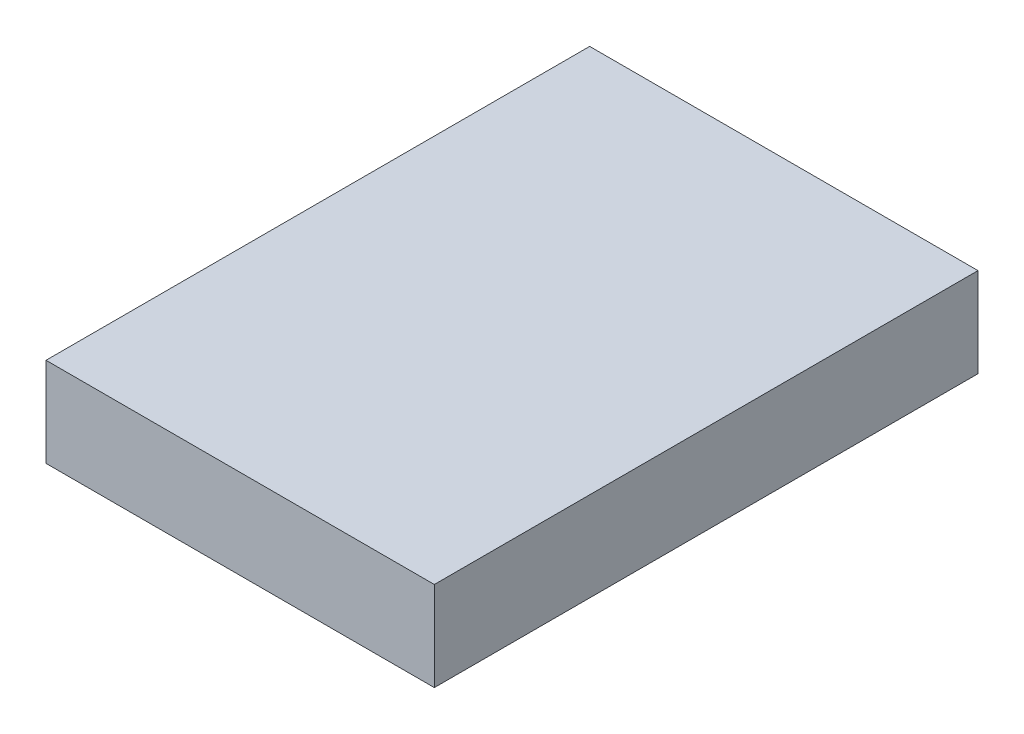
ISO-10303-21;
HEADER;
FILE_DESCRIPTION(('STEP AP214'),'2;1');
FILE_NAME('part.step','',(''),(''),'','','');
FILE_SCHEMA(('AUTOMOTIVE_DESIGN { 1 0 10303 214 1 1 1 1 }'));
ENDSEC;
DATA;
#1=APPLICATION_CONTEXT('core data for automotive mechanical design processes');
#2=APPLICATION_PROTOCOL_DEFINITION('international standard','automotive_design',2000,#1);
#3=PRODUCT_CONTEXT('',#1,'mechanical');
#4=PRODUCT('Part','Part','',(#3));
#5=PRODUCT_RELATED_PRODUCT_CATEGORY('part','',(#4));
#6=PRODUCT_DEFINITION_FORMATION('','',#4);
#7=PRODUCT_DEFINITION_CONTEXT('part definition',#1,'design');
#8=PRODUCT_DEFINITION('design','',#6,#7);
#9=PRODUCT_DEFINITION_SHAPE('','',#8);
#10=(LENGTH_UNIT() NAMED_UNIT(*) SI_UNIT(.MILLI.,.METRE.));
#11=(NAMED_UNIT(*) PLANE_ANGLE_UNIT() SI_UNIT($,.RADIAN.));
#12=(NAMED_UNIT(*) SI_UNIT($,.STERADIAN.) SOLID_ANGLE_UNIT());
#13=UNCERTAINTY_MEASURE_WITH_UNIT(LENGTH_MEASURE(1.E-05),#10,'distance_accuracy_value','');
#14=(GEOMETRIC_REPRESENTATION_CONTEXT(3) GLOBAL_UNCERTAINTY_ASSIGNED_CONTEXT((#13)) GLOBAL_UNIT_ASSIGNED_CONTEXT((#10,
#11,#12)) REPRESENTATION_CONTEXT('',''));
#15=CARTESIAN_POINT('',(0.,0.,0.));
#16=DIRECTION('',(0.,0.,1.));
#17=DIRECTION('',(1.,0.,0.));
#18=AXIS2_PLACEMENT_3D('',#15,#16,#17);
#19=CARTESIAN_POINT('',(-2.08762886597938,5.75,-18.8530927835052));
#20=DIRECTION('',(1.,0.,0.));
#21=DIRECTION('',(0.,0.,-1.));
#22=AXIS2_PLACEMENT_3D('',#19,#20,#21);
#23=PLANE('',#22);
#24=DIRECTION('',(0.,0.,1.));
#25=VECTOR('',#24,1.);
#26=CARTESIAN_POINT('',(-2.08762886597938,0.,-18.8530927835052));
#27=LINE('',#26,#25);
#28=CARTESIAN_POINT('',(-2.08762886597938,0.,-18.8530927835052));
#29=VERTEX_POINT('',#28);
#30=CARTESIAN_POINT('',(-2.08762886597938,0.,16.1469072164948));
#31=VERTEX_POINT('',#30);
#32=EDGE_CURVE('E95',#29,#31,#27,.T.);
#33=ORIENTED_EDGE('',*,*,#32,.T.);
#34=DIRECTION('',(0.,-1.,0.));
#35=VECTOR('',#34,1.);
#36=CARTESIAN_POINT('',(-2.08762886597938,5.75,16.1469072164948));
#37=LINE('',#36,#35);
#38=CARTESIAN_POINT('',(-2.08762886597938,5.75,16.1469072164948));
#39=VERTEX_POINT('',#38);
#40=EDGE_CURVE('E11',#39,#31,#37,.T.);
#41=ORIENTED_EDGE('',*,*,#40,.F.);
#42=DIRECTION('',(0.,0.,1.));
#43=VECTOR('',#42,1.);
#44=CARTESIAN_POINT('',(-2.08762886597938,5.75,-18.8530927835052));
#45=LINE('',#44,#43);
#46=CARTESIAN_POINT('',(-2.08762886597938,5.75,-18.8530927835052));
#47=VERTEX_POINT('',#46);
#48=EDGE_CURVE('E83',#47,#39,#45,.T.);
#49=ORIENTED_EDGE('',*,*,#48,.F.);
#50=DIRECTION('',(0.,-1.,0.));
#51=VECTOR('',#50,1.);
#52=CARTESIAN_POINT('',(-2.08762886597938,5.75,-18.8530927835052));
#53=LINE('',#52,#51);
#54=EDGE_CURVE('E91',#47,#29,#53,.T.);
#55=ORIENTED_EDGE('',*,*,#54,.T.);
#56=EDGE_LOOP('',(#33,#41,#49,#55));
#57=FACE_BOUND('',#56,.T.);
#58=ADVANCED_FACE('F32',(#57),#23,.F.);
#59=CARTESIAN_POINT('',(-2.08762886597938,5.75,16.1469072164948));
#60=DIRECTION('',(0.,0.,-1.));
#61=DIRECTION('',(-1.,0.,0.));
#62=AXIS2_PLACEMENT_3D('',#59,#60,#61);
#63=PLANE('',#62);
#64=DIRECTION('',(1.,0.,0.));
#65=VECTOR('',#64,1.);
#66=CARTESIAN_POINT('',(-2.08762886597938,0.,16.1469072164948));
#67=LINE('',#66,#65);
#68=CARTESIAN_POINT('',(22.9123711340206,0.,16.1469072164948));
#69=VERTEX_POINT('',#68);
#70=EDGE_CURVE('E87',#31,#69,#67,.T.);
#71=ORIENTED_EDGE('',*,*,#70,.T.);
#72=DIRECTION('',(0.,-1.,0.));
#73=VECTOR('',#72,1.);
#74=CARTESIAN_POINT('',(22.9123711340206,5.75,16.1469072164948));
#75=LINE('',#74,#73);
#76=CARTESIAN_POINT('',(22.9123711340206,5.75,16.1469072164948));
#77=VERTEX_POINT('',#76);
#78=EDGE_CURVE('E40',#77,#69,#75,.T.);
#79=ORIENTED_EDGE('',*,*,#78,.F.);
#80=DIRECTION('',(1.,0.,0.));
#81=VECTOR('',#80,1.);
#82=CARTESIAN_POINT('',(-2.08762886597938,5.75,16.1469072164948));
#83=LINE('',#82,#81);
#84=EDGE_CURVE('E78',#39,#77,#83,.T.);
#85=ORIENTED_EDGE('',*,*,#84,.F.);
#86=ORIENTED_EDGE('',*,*,#40,.T.);
#87=EDGE_LOOP('',(#71,#79,#85,#86));
#88=FACE_BOUND('',#87,.T.);
#89=ADVANCED_FACE('F86',(#88),#63,.F.);
#90=CARTESIAN_POINT('',(22.9123711340206,5.75,-18.8530927835052));
#91=DIRECTION('',(-1.,0.,0.));
#92=DIRECTION('',(0.,0.,1.));
#93=AXIS2_PLACEMENT_3D('',#90,#91,#92);
#94=PLANE('',#93);
#95=DIRECTION('',(0.,0.,-1.));
#96=VECTOR('',#95,1.);
#97=CARTESIAN_POINT('',(22.9123711340206,0.,-18.8530927835052));
#98=LINE('',#97,#96);
#99=CARTESIAN_POINT('',(22.9123711340206,0.,-18.8530927835052));
#100=VERTEX_POINT('',#99);
#101=EDGE_CURVE('E65',#69,#100,#98,.T.);
#102=ORIENTED_EDGE('',*,*,#101,.T.);
#103=DIRECTION('',(0.,-1.,0.));
#104=VECTOR('',#103,1.);
#105=CARTESIAN_POINT('',(22.9123711340206,5.75,-18.8530927835052));
#106=LINE('',#105,#104);
#107=CARTESIAN_POINT('',(22.9123711340206,5.75,-18.8530927835052));
#108=VERTEX_POINT('',#107);
#109=EDGE_CURVE('E88',#108,#100,#106,.T.);
#110=ORIENTED_EDGE('',*,*,#109,.F.);
#111=DIRECTION('',(0.,0.,-1.));
#112=VECTOR('',#111,1.);
#113=CARTESIAN_POINT('',(22.9123711340206,5.75,-18.8530927835052));
#114=LINE('',#113,#112);
#115=EDGE_CURVE('E81',#77,#108,#114,.T.);
#116=ORIENTED_EDGE('',*,*,#115,.F.);
#117=ORIENTED_EDGE('',*,*,#78,.T.);
#118=EDGE_LOOP('',(#102,#110,#116,#117));
#119=FACE_BOUND('',#118,.T.);
#120=ADVANCED_FACE('F89',(#119),#94,.F.);
#121=CARTESIAN_POINT('',(-2.08762886597938,5.75,-18.8530927835052));
#122=DIRECTION('',(0.,0.,1.));
#123=DIRECTION('',(1.,0.,0.));
#124=AXIS2_PLACEMENT_3D('',#121,#122,#123);
#125=PLANE('',#124);
#126=DIRECTION('',(-1.,0.,0.));
#127=VECTOR('',#126,1.);
#128=CARTESIAN_POINT('',(-2.08762886597938,0.,-18.8530927835052));
#129=LINE('',#128,#127);
#130=EDGE_CURVE('E71',#100,#29,#129,.T.);
#131=ORIENTED_EDGE('',*,*,#130,.T.);
#132=ORIENTED_EDGE('',*,*,#54,.F.);
#133=DIRECTION('',(-1.,0.,0.));
#134=VECTOR('',#133,1.);
#135=CARTESIAN_POINT('',(-2.08762886597938,5.75,-18.8530927835052));
#136=LINE('',#135,#134);
#137=EDGE_CURVE('E48',#108,#47,#136,.T.);
#138=ORIENTED_EDGE('',*,*,#137,.F.);
#139=ORIENTED_EDGE('',*,*,#109,.T.);
#140=EDGE_LOOP('',(#131,#132,#138,#139));
#141=FACE_BOUND('',#140,.T.);
#142=ADVANCED_FACE('F102',(#141),#125,.F.);
#143=CARTESIAN_POINT('',(0.,5.75,0.));
#144=DIRECTION('',(0.,1.,0.));
#145=DIRECTION('',(0.,0.,1.));
#146=AXIS2_PLACEMENT_3D('',#143,#144,#145);
#147=PLANE('',#146);
#148=ORIENTED_EDGE('',*,*,#48,.T.);
#149=ORIENTED_EDGE('',*,*,#84,.T.);
#150=ORIENTED_EDGE('',*,*,#115,.T.);
#151=ORIENTED_EDGE('',*,*,#137,.T.);
#152=EDGE_LOOP('',(#148,#149,#150,#151));
#153=FACE_BOUND('',#152,.T.);
#154=ADVANCED_FACE('F79',(#153),#147,.T.);
#155=CARTESIAN_POINT('',(0.,0.,0.));
#156=DIRECTION('',(0.,1.,0.));
#157=DIRECTION('',(0.,0.,1.));
#158=AXIS2_PLACEMENT_3D('',#155,#156,#157);
#159=PLANE('',#158);
#160=ORIENTED_EDGE('',*,*,#32,.F.);
#161=ORIENTED_EDGE('',*,*,#130,.F.);
#162=ORIENTED_EDGE('',*,*,#101,.F.);
#163=ORIENTED_EDGE('',*,*,#70,.F.);
#164=EDGE_LOOP('',(#160,#161,#162,#163));
#165=FACE_BOUND('',#164,.T.);
#166=ADVANCED_FACE('F105',(#165),#159,.F.);
#167=CLOSED_SHELL('',(#58,#89,#120,#142,#154,#166));
#168=MANIFOLD_SOLID_BREP('B2',#167);
#169=ADVANCED_BREP_SHAPE_REPRESENTATION('',(#18,#168),#14);
#170=SHAPE_DEFINITION_REPRESENTATION(#9,#169);
ENDSEC;
END-ISO-10303-21;
